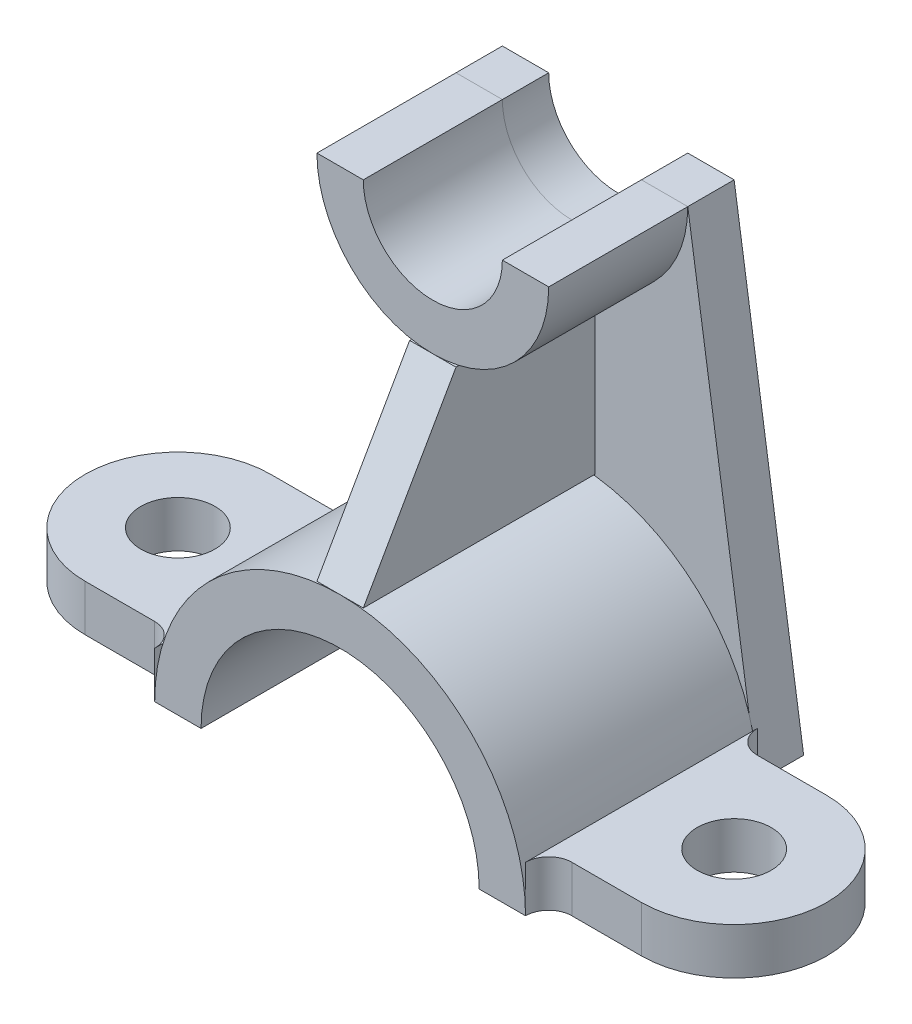
ISO-10303-21;
HEADER;
FILE_DESCRIPTION(('STEP AP214'),'2;1');
FILE_NAME('part.step','',(''),(''),'','','');
FILE_SCHEMA(('AUTOMOTIVE_DESIGN { 1 0 10303 214 1 1 1 1 }'));
ENDSEC;
DATA;
#1=APPLICATION_CONTEXT('core data for automotive mechanical design processes');
#2=APPLICATION_PROTOCOL_DEFINITION('international standard','automotive_design',2000,#1);
#3=PRODUCT_CONTEXT('',#1,'mechanical');
#4=PRODUCT('Part','Part','',(#3));
#5=PRODUCT_RELATED_PRODUCT_CATEGORY('part','',(#4));
#6=PRODUCT_DEFINITION_FORMATION('','',#4);
#7=PRODUCT_DEFINITION_CONTEXT('part definition',#1,'design');
#8=PRODUCT_DEFINITION('design','',#6,#7);
#9=PRODUCT_DEFINITION_SHAPE('','',#8);
#10=(LENGTH_UNIT() NAMED_UNIT(*) SI_UNIT(.MILLI.,.METRE.));
#11=(NAMED_UNIT(*) PLANE_ANGLE_UNIT() SI_UNIT($,.RADIAN.));
#12=(NAMED_UNIT(*) SI_UNIT($,.STERADIAN.) SOLID_ANGLE_UNIT());
#13=UNCERTAINTY_MEASURE_WITH_UNIT(LENGTH_MEASURE(1.E-05),#10,'distance_accuracy_value','');
#14=(GEOMETRIC_REPRESENTATION_CONTEXT(3) GLOBAL_UNCERTAINTY_ASSIGNED_CONTEXT((#13)) GLOBAL_UNIT_ASSIGNED_CONTEXT((#10,
#11,#12)) REPRESENTATION_CONTEXT('',''));
#15=CARTESIAN_POINT('',(0.,0.,0.));
#16=DIRECTION('',(0.,0.,1.));
#17=DIRECTION('',(1.,0.,0.));
#18=AXIS2_PLACEMENT_3D('',#15,#16,#17);
#19=CARTESIAN_POINT('',(-40.,10.,0.));
#20=DIRECTION('',(1.,0.,0.));
#21=DIRECTION('',(0.,0.,1.));
#22=AXIS2_PLACEMENT_3D('',#19,#20,#21);
#23=PLANE('',#22);
#24=DIRECTION('',(0.,0.,-1.));
#25=VECTOR('',#24,1.);
#26=CARTESIAN_POINT('',(-40.,0.,0.));
#27=LINE('',#26,#25);
#28=CARTESIAN_POINT('',(-40.,0.,0.));
#29=VERTEX_POINT('',#28);
#30=CARTESIAN_POINT('',(-40.,0.,-50.));
#31=VERTEX_POINT('',#30);
#32=EDGE_CURVE('E133',#29,#31,#27,.T.);
#33=ORIENTED_EDGE('',*,*,#32,.T.);
#34=DIRECTION('',(0.,-1.,0.));
#35=VECTOR('',#34,1.);
#36=CARTESIAN_POINT('',(-40.,10.,-50.));
#37=LINE('',#36,#35);
#38=CARTESIAN_POINT('',(-40.,10.,-50.));
#39=VERTEX_POINT('',#38);
#40=EDGE_CURVE('E132',#39,#31,#37,.T.);
#41=ORIENTED_EDGE('',*,*,#40,.F.);
#42=DIRECTION('',(0.,0.,-1.));
#43=VECTOR('',#42,1.);
#44=CARTESIAN_POINT('',(-40.,10.,0.));
#45=LINE('',#44,#43);
#46=CARTESIAN_POINT('',(-40.,10.,0.));
#47=VERTEX_POINT('',#46);
#48=EDGE_CURVE('E149',#47,#39,#45,.T.);
#49=ORIENTED_EDGE('',*,*,#48,.F.);
#50=DIRECTION('',(0.,-1.,0.));
#51=VECTOR('',#50,1.);
#52=CARTESIAN_POINT('',(-40.,10.,0.));
#53=LINE('',#52,#51);
#54=EDGE_CURVE('E12',#47,#29,#53,.T.);
#55=ORIENTED_EDGE('',*,*,#54,.T.);
#56=EDGE_LOOP('',(#33,#41,#49,#55));
#57=FACE_BOUND('',#56,.T.);
#58=ADVANCED_FACE('F46',(#57),#23,.T.);
#59=CARTESIAN_POINT('',(-45.,10.,0.));
#60=DIRECTION('',(0.,-1.,0.));
#61=DIRECTION('',(0.,0.,-1.));
#62=AXIS2_PLACEMENT_3D('',#59,#60,#61);
#63=CYLINDRICAL_SURFACE('',#62,5.);
#64=CARTESIAN_POINT('',(-45.,0.,0.));
#65=DIRECTION('',(0.,-1.,0.));
#66=DIRECTION('',(0.,0.,1.));
#67=AXIS2_PLACEMENT_3D('',#64,#65,#66);
#68=CIRCLE('',#67,5.);
#69=CARTESIAN_POINT('',(-45.,0.,-5.));
#70=VERTEX_POINT('',#69);
#71=EDGE_CURVE('E136',#29,#70,#68,.F.);
#72=ORIENTED_EDGE('',*,*,#71,.F.);
#73=ORIENTED_EDGE('',*,*,#54,.F.);
#74=CARTESIAN_POINT('',(-45.,10.,0.));
#75=DIRECTION('',(0.,-1.,0.));
#76=DIRECTION('',(0.,0.,1.));
#77=AXIS2_PLACEMENT_3D('',#74,#75,#76);
#78=CIRCLE('',#77,5.);
#79=CARTESIAN_POINT('',(-45.,10.,-5.));
#80=VERTEX_POINT('',#79);
#81=EDGE_CURVE('E94',#47,#80,#78,.F.);
#82=ORIENTED_EDGE('',*,*,#81,.T.);
#83=DIRECTION('',(0.,-1.,0.));
#84=VECTOR('',#83,1.);
#85=CARTESIAN_POINT('',(-45.,10.,-5.));
#86=LINE('',#85,#84);
#87=EDGE_CURVE('E54',#80,#70,#86,.T.);
#88=ORIENTED_EDGE('',*,*,#87,.T.);
#89=EDGE_LOOP('',(#72,#73,#82,#88));
#90=FACE_BOUND('',#89,.T.);
#91=ADVANCED_FACE('F155',(#90),#63,.F.);
#92=CARTESIAN_POINT('',(0.,10.,-5.));
#93=DIRECTION('',(0.,0.,-1.));
#94=DIRECTION('',(1.,0.,0.));
#95=AXIS2_PLACEMENT_3D('',#92,#93,#94);
#96=PLANE('',#95);
#97=DIRECTION('',(-1.,0.,0.));
#98=VECTOR('',#97,1.);
#99=CARTESIAN_POINT('',(0.,0.,-5.));
#100=LINE('',#99,#98);
#101=CARTESIAN_POINT('',(-60.,0.,-5.));
#102=VERTEX_POINT('',#101);
#103=EDGE_CURVE('E139',#70,#102,#100,.T.);
#104=ORIENTED_EDGE('',*,*,#103,.F.);
#105=ORIENTED_EDGE('',*,*,#87,.F.);
#106=DIRECTION('',(-1.,0.,0.));
#107=VECTOR('',#106,1.);
#108=CARTESIAN_POINT('',(0.,10.,-5.));
#109=LINE('',#108,#107);
#110=CARTESIAN_POINT('',(-60.,10.,-5.));
#111=VERTEX_POINT('',#110);
#112=EDGE_CURVE('E123',#80,#111,#109,.T.);
#113=ORIENTED_EDGE('',*,*,#112,.T.);
#114=DIRECTION('',(0.,-1.,0.));
#115=VECTOR('',#114,1.);
#116=CARTESIAN_POINT('',(-60.,10.,-5.));
#117=LINE('',#116,#115);
#118=EDGE_CURVE('E117',#111,#102,#117,.T.);
#119=ORIENTED_EDGE('',*,*,#118,.T.);
#120=EDGE_LOOP('',(#104,#105,#113,#119));
#121=FACE_BOUND('',#120,.T.);
#122=ADVANCED_FACE('F178',(#121),#96,.F.);
#123=CARTESIAN_POINT('',(-60.,10.,-25.));
#124=DIRECTION('',(0.,-1.,0.));
#125=DIRECTION('',(0.,0.,-1.));
#126=AXIS2_PLACEMENT_3D('',#123,#124,#125);
#127=CYLINDRICAL_SURFACE('',#126,20.);
#128=CARTESIAN_POINT('',(-60.,0.,-25.));
#129=DIRECTION('',(0.,-1.,0.));
#130=DIRECTION('',(0.,0.,1.));
#131=AXIS2_PLACEMENT_3D('',#128,#129,#130);
#132=CIRCLE('',#131,20.);
#133=CARTESIAN_POINT('',(-60.,0.,-45.));
#134=VERTEX_POINT('',#133);
#135=EDGE_CURVE('E142',#102,#134,#132,.T.);
#136=ORIENTED_EDGE('',*,*,#135,.F.);
#137=ORIENTED_EDGE('',*,*,#118,.F.);
#138=CARTESIAN_POINT('',(-60.,10.,-25.));
#139=DIRECTION('',(0.,-1.,0.));
#140=DIRECTION('',(0.,0.,1.));
#141=AXIS2_PLACEMENT_3D('',#138,#139,#140);
#142=CIRCLE('',#141,20.);
#143=CARTESIAN_POINT('',(-60.,10.,-45.));
#144=VERTEX_POINT('',#143);
#145=EDGE_CURVE('E107',#111,#144,#142,.T.);
#146=ORIENTED_EDGE('',*,*,#145,.T.);
#147=DIRECTION('',(0.,-1.,0.));
#148=VECTOR('',#147,1.);
#149=CARTESIAN_POINT('',(-60.,10.,-45.));
#150=LINE('',#149,#148);
#151=EDGE_CURVE('E112',#144,#134,#150,.T.);
#152=ORIENTED_EDGE('',*,*,#151,.T.);
#153=EDGE_LOOP('',(#136,#137,#146,#152));
#154=FACE_BOUND('',#153,.T.);
#155=ADVANCED_FACE('F120',(#154),#127,.T.);
#156=CARTESIAN_POINT('',(0.,10.,-45.));
#157=DIRECTION('',(0.,0.,-1.));
#158=DIRECTION('',(1.,0.,0.));
#159=AXIS2_PLACEMENT_3D('',#156,#157,#158);
#160=PLANE('',#159);
#161=DIRECTION('',(-1.,0.,0.));
#162=VECTOR('',#161,1.);
#163=CARTESIAN_POINT('',(0.,0.,-45.));
#164=LINE('',#163,#162);
#165=CARTESIAN_POINT('',(-45.,0.,-45.));
#166=VERTEX_POINT('',#165);
#167=EDGE_CURVE('E114',#166,#134,#164,.T.);
#168=ORIENTED_EDGE('',*,*,#167,.T.);
#169=ORIENTED_EDGE('',*,*,#151,.F.);
#170=DIRECTION('',(-1.,0.,0.));
#171=VECTOR('',#170,1.);
#172=CARTESIAN_POINT('',(0.,10.,-45.));
#173=LINE('',#172,#171);
#174=CARTESIAN_POINT('',(-45.,10.,-45.));
#175=VERTEX_POINT('',#174);
#176=EDGE_CURVE('E102',#175,#144,#173,.T.);
#177=ORIENTED_EDGE('',*,*,#176,.F.);
#178=DIRECTION('',(0.,-1.,0.));
#179=VECTOR('',#178,1.);
#180=CARTESIAN_POINT('',(-45.,10.,-45.));
#181=LINE('',#180,#179);
#182=EDGE_CURVE('E118',#175,#166,#181,.T.);
#183=ORIENTED_EDGE('',*,*,#182,.T.);
#184=EDGE_LOOP('',(#168,#169,#177,#183));
#185=FACE_BOUND('',#184,.T.);
#186=ADVANCED_FACE('F113',(#185),#160,.T.);
#187=CARTESIAN_POINT('',(-45.,10.,-50.));
#188=DIRECTION('',(0.,-1.,0.));
#189=DIRECTION('',(0.,0.,-1.));
#190=AXIS2_PLACEMENT_3D('',#187,#188,#189);
#191=CYLINDRICAL_SURFACE('',#190,5.);
#192=CARTESIAN_POINT('',(-45.,0.,-50.));
#193=DIRECTION('',(0.,-1.,0.));
#194=DIRECTION('',(0.,0.,1.));
#195=AXIS2_PLACEMENT_3D('',#192,#193,#194);
#196=CIRCLE('',#195,5.);
#197=EDGE_CURVE('E82',#31,#166,#196,.T.);
#198=ORIENTED_EDGE('',*,*,#197,.T.);
#199=ORIENTED_EDGE('',*,*,#182,.F.);
#200=CARTESIAN_POINT('',(-45.,10.,-50.));
#201=DIRECTION('',(0.,-1.,0.));
#202=DIRECTION('',(0.,0.,1.));
#203=AXIS2_PLACEMENT_3D('',#200,#201,#202);
#204=CIRCLE('',#203,5.);
#205=EDGE_CURVE('E62',#39,#175,#204,.T.);
#206=ORIENTED_EDGE('',*,*,#205,.F.);
#207=ORIENTED_EDGE('',*,*,#40,.T.);
#208=EDGE_LOOP('',(#198,#199,#206,#207));
#209=FACE_BOUND('',#208,.T.);
#210=ADVANCED_FACE('F163',(#209),#191,.F.);
#211=CARTESIAN_POINT('',(-60.,10.,-25.));
#212=DIRECTION('',(0.,-1.,0.));
#213=DIRECTION('',(0.,0.,-1.));
#214=AXIS2_PLACEMENT_3D('',#211,#212,#213);
#215=CYLINDRICAL_SURFACE('',#214,8.00000000000001);
#216=CARTESIAN_POINT('',(-60.,10.,-25.));
#217=DIRECTION('',(0.,-1.,0.));
#218=DIRECTION('',(0.,0.,1.));
#219=AXIS2_PLACEMENT_3D('',#216,#217,#218);
#220=CIRCLE('',#219,8.00000000000001);
#221=CARTESIAN_POINT('',(-60.,10.,-17.));
#222=VERTEX_POINT('',#221);
#223=EDGE_CURVE('E129',#222,#222,#220,.T.);
#224=ORIENTED_EDGE('',*,*,#223,.F.);
#225=EDGE_LOOP('',(#224));
#226=FACE_BOUND('',#225,.T.);
#227=CARTESIAN_POINT('',(-60.,0.,-25.));
#228=DIRECTION('',(0.,-1.,0.));
#229=DIRECTION('',(0.,0.,1.));
#230=AXIS2_PLACEMENT_3D('',#227,#228,#229);
#231=CIRCLE('',#230,8.00000000000001);
#232=CARTESIAN_POINT('',(-60.,0.,-17.));
#233=VERTEX_POINT('',#232);
#234=EDGE_CURVE('E146',#233,#233,#231,.T.);
#235=ORIENTED_EDGE('',*,*,#234,.T.);
#236=EDGE_LOOP('',(#235));
#237=FACE_BOUND('',#236,.T.);
#238=ADVANCED_FACE('F165',(#226,#237),#215,.F.);
#239=CARTESIAN_POINT('',(0.,10.,0.));
#240=DIRECTION('',(0.,1.,0.));
#241=DIRECTION('',(0.,0.,1.));
#242=AXIS2_PLACEMENT_3D('',#239,#240,#241);
#243=PLANE('',#242);
#244=ORIENTED_EDGE('',*,*,#48,.T.);
#245=ORIENTED_EDGE('',*,*,#205,.T.);
#246=ORIENTED_EDGE('',*,*,#176,.T.);
#247=ORIENTED_EDGE('',*,*,#145,.F.);
#248=ORIENTED_EDGE('',*,*,#112,.F.);
#249=ORIENTED_EDGE('',*,*,#81,.F.);
#250=EDGE_LOOP('',(#244,#245,#246,#247,#248,#249));
#251=FACE_BOUND('',#250,.T.);
#252=ORIENTED_EDGE('',*,*,#223,.T.);
#253=EDGE_LOOP('',(#252));
#254=FACE_BOUND('',#253,.T.);
#255=ADVANCED_FACE('F104',(#251,#254),#243,.T.);
#256=CARTESIAN_POINT('',(0.,0.,0.));
#257=DIRECTION('',(0.,1.,0.));
#258=DIRECTION('',(0.,0.,1.));
#259=AXIS2_PLACEMENT_3D('',#256,#257,#258);
#260=PLANE('',#259);
#261=ORIENTED_EDGE('',*,*,#32,.F.);
#262=ORIENTED_EDGE('',*,*,#71,.T.);
#263=ORIENTED_EDGE('',*,*,#103,.T.);
#264=ORIENTED_EDGE('',*,*,#135,.T.);
#265=ORIENTED_EDGE('',*,*,#167,.F.);
#266=ORIENTED_EDGE('',*,*,#197,.F.);
#267=EDGE_LOOP('',(#261,#262,#263,#264,#265,#266));
#268=FACE_BOUND('',#267,.T.);
#269=ORIENTED_EDGE('',*,*,#234,.F.);
#270=EDGE_LOOP('',(#269));
#271=FACE_BOUND('',#270,.T.);
#272=ADVANCED_FACE('F157',(#268,#271),#260,.F.);
#273=CLOSED_SHELL('',(#58,#91,#122,#155,#186,#210,#238,#255,#272));
#274=MANIFOLD_SOLID_BREP('B2',#273);
#275=CARTESIAN_POINT('',(40.,10.,0.));
#276=DIRECTION('',(-1.,0.,0.));
#277=DIRECTION('',(0.,0.,1.));
#278=AXIS2_PLACEMENT_3D('',#275,#276,#277);
#279=PLANE('',#278);
#280=DIRECTION('',(0.,0.,-1.));
#281=VECTOR('',#280,1.);
#282=CARTESIAN_POINT('',(40.,0.,0.));
#283=LINE('',#282,#281);
#284=CARTESIAN_POINT('',(40.,0.,0.));
#285=VERTEX_POINT('',#284);
#286=CARTESIAN_POINT('',(40.,0.,-50.));
#287=VERTEX_POINT('',#286);
#288=EDGE_CURVE('E366',#285,#287,#283,.T.);
#289=ORIENTED_EDGE('',*,*,#288,.F.);
#290=DIRECTION('',(0.,-1.,0.));
#291=VECTOR('',#290,1.);
#292=CARTESIAN_POINT('',(40.,10.,0.));
#293=LINE('',#292,#291);
#294=CARTESIAN_POINT('',(40.,10.,0.));
#295=VERTEX_POINT('',#294);
#296=EDGE_CURVE('E44',#295,#285,#293,.T.);
#297=ORIENTED_EDGE('',*,*,#296,.F.);
#298=DIRECTION('',(0.,0.,-1.));
#299=VECTOR('',#298,1.);
#300=CARTESIAN_POINT('',(40.,10.,0.));
#301=LINE('',#300,#299);
#302=CARTESIAN_POINT('',(40.,10.,-50.));
#303=VERTEX_POINT('',#302);
#304=EDGE_CURVE('E381',#295,#303,#301,.T.);
#305=ORIENTED_EDGE('',*,*,#304,.T.);
#306=DIRECTION('',(0.,-1.,0.));
#307=VECTOR('',#306,1.);
#308=CARTESIAN_POINT('',(40.,10.,-50.));
#309=LINE('',#308,#307);
#310=EDGE_CURVE('E296',#303,#287,#309,.T.);
#311=ORIENTED_EDGE('',*,*,#310,.T.);
#312=EDGE_LOOP('',(#289,#297,#305,#311));
#313=FACE_BOUND('',#312,.T.);
#314=ADVANCED_FACE('F280',(#313),#279,.T.);
#315=CARTESIAN_POINT('',(45.,10.,0.));
#316=DIRECTION('',(0.,-1.,0.));
#317=DIRECTION('',(0.,0.,-1.));
#318=AXIS2_PLACEMENT_3D('',#315,#316,#317);
#319=CYLINDRICAL_SURFACE('',#318,5.);
#320=CARTESIAN_POINT('',(45.,0.,0.));
#321=DIRECTION('',(0.,1.,0.));
#322=DIRECTION('',(0.,0.,1.));
#323=AXIS2_PLACEMENT_3D('',#320,#321,#322);
#324=CIRCLE('',#323,5.);
#325=CARTESIAN_POINT('',(45.,0.,-5.));
#326=VERTEX_POINT('',#325);
#327=EDGE_CURVE('E368',#285,#326,#324,.F.);
#328=ORIENTED_EDGE('',*,*,#327,.T.);
#329=DIRECTION('',(0.,-1.,0.));
#330=VECTOR('',#329,1.);
#331=CARTESIAN_POINT('',(45.,10.,-5.));
#332=LINE('',#331,#330);
#333=CARTESIAN_POINT('',(45.,10.,-5.));
#334=VERTEX_POINT('',#333);
#335=EDGE_CURVE('E288',#334,#326,#332,.T.);
#336=ORIENTED_EDGE('',*,*,#335,.F.);
#337=CARTESIAN_POINT('',(45.,10.,0.));
#338=DIRECTION('',(0.,1.,0.));
#339=DIRECTION('',(0.,0.,1.));
#340=AXIS2_PLACEMENT_3D('',#337,#338,#339);
#341=CIRCLE('',#340,5.);
#342=EDGE_CURVE('E495',#295,#334,#341,.F.);
#343=ORIENTED_EDGE('',*,*,#342,.F.);
#344=ORIENTED_EDGE('',*,*,#296,.T.);
#345=EDGE_LOOP('',(#328,#336,#343,#344));
#346=FACE_BOUND('',#345,.T.);
#347=ADVANCED_FACE('F406',(#346),#319,.F.);
#348=CARTESIAN_POINT('',(0.,10.,-5.));
#349=DIRECTION('',(0.,0.,-1.));
#350=DIRECTION('',(-1.,0.,0.));
#351=AXIS2_PLACEMENT_3D('',#348,#349,#350);
#352=PLANE('',#351);
#353=DIRECTION('',(1.,0.,0.));
#354=VECTOR('',#353,1.);
#355=CARTESIAN_POINT('',(0.,0.,-5.));
#356=LINE('',#355,#354);
#357=CARTESIAN_POINT('',(60.,0.,-5.));
#358=VERTEX_POINT('',#357);
#359=EDGE_CURVE('E370',#326,#358,#356,.T.);
#360=ORIENTED_EDGE('',*,*,#359,.T.);
#361=DIRECTION('',(0.,-1.,0.));
#362=VECTOR('',#361,1.);
#363=CARTESIAN_POINT('',(60.,10.,-5.));
#364=LINE('',#363,#362);
#365=CARTESIAN_POINT('',(60.,10.,-5.));
#366=VERTEX_POINT('',#365);
#367=EDGE_CURVE('E355',#366,#358,#364,.T.);
#368=ORIENTED_EDGE('',*,*,#367,.F.);
#369=DIRECTION('',(1.,0.,0.));
#370=VECTOR('',#369,1.);
#371=CARTESIAN_POINT('',(0.,10.,-5.));
#372=LINE('',#371,#370);
#373=EDGE_CURVE('E343',#334,#366,#372,.T.);
#374=ORIENTED_EDGE('',*,*,#373,.F.);
#375=ORIENTED_EDGE('',*,*,#335,.T.);
#376=EDGE_LOOP('',(#360,#368,#374,#375));
#377=FACE_BOUND('',#376,.T.);
#378=ADVANCED_FACE('F388',(#377),#352,.F.);
#379=CARTESIAN_POINT('',(60.,10.,-25.));
#380=DIRECTION('',(0.,-1.,0.));
#381=DIRECTION('',(0.,0.,-1.));
#382=AXIS2_PLACEMENT_3D('',#379,#380,#381);
#383=CYLINDRICAL_SURFACE('',#382,20.);
#384=CARTESIAN_POINT('',(60.,0.,-25.));
#385=DIRECTION('',(0.,1.,0.));
#386=DIRECTION('',(0.,0.,1.));
#387=AXIS2_PLACEMENT_3D('',#384,#385,#386);
#388=CIRCLE('',#387,20.);
#389=CARTESIAN_POINT('',(60.,0.,-45.));
#390=VERTEX_POINT('',#389);
#391=EDGE_CURVE('E352',#358,#390,#388,.T.);
#392=ORIENTED_EDGE('',*,*,#391,.T.);
#393=DIRECTION('',(0.,-1.,0.));
#394=VECTOR('',#393,1.);
#395=CARTESIAN_POINT('',(60.,10.,-45.));
#396=LINE('',#395,#394);
#397=CARTESIAN_POINT('',(60.,10.,-45.));
#398=VERTEX_POINT('',#397);
#399=EDGE_CURVE('E349',#398,#390,#396,.T.);
#400=ORIENTED_EDGE('',*,*,#399,.F.);
#401=CARTESIAN_POINT('',(60.,10.,-25.));
#402=DIRECTION('',(0.,1.,0.));
#403=DIRECTION('',(0.,0.,1.));
#404=AXIS2_PLACEMENT_3D('',#401,#402,#403);
#405=CIRCLE('',#404,20.);
#406=EDGE_CURVE('E334',#366,#398,#405,.T.);
#407=ORIENTED_EDGE('',*,*,#406,.F.);
#408=ORIENTED_EDGE('',*,*,#367,.T.);
#409=EDGE_LOOP('',(#392,#400,#407,#408));
#410=FACE_BOUND('',#409,.T.);
#411=ADVANCED_FACE('F350',(#410),#383,.T.);
#412=CARTESIAN_POINT('',(0.,10.,-45.));
#413=DIRECTION('',(0.,0.,-1.));
#414=DIRECTION('',(-1.,0.,0.));
#415=AXIS2_PLACEMENT_3D('',#412,#413,#414);
#416=PLANE('',#415);
#417=DIRECTION('',(1.,0.,0.));
#418=VECTOR('',#417,1.);
#419=CARTESIAN_POINT('',(0.,0.,-45.));
#420=LINE('',#419,#418);
#421=CARTESIAN_POINT('',(45.,0.,-45.));
#422=VERTEX_POINT('',#421);
#423=EDGE_CURVE('E373',#422,#390,#420,.T.);
#424=ORIENTED_EDGE('',*,*,#423,.F.);
#425=DIRECTION('',(0.,-1.,0.));
#426=VECTOR('',#425,1.);
#427=CARTESIAN_POINT('',(45.,10.,-45.));
#428=LINE('',#427,#426);
#429=CARTESIAN_POINT('',(45.,10.,-45.));
#430=VERTEX_POINT('',#429);
#431=EDGE_CURVE('E315',#430,#422,#428,.T.);
#432=ORIENTED_EDGE('',*,*,#431,.F.);
#433=DIRECTION('',(1.,0.,0.));
#434=VECTOR('',#433,1.);
#435=CARTESIAN_POINT('',(0.,10.,-45.));
#436=LINE('',#435,#434);
#437=EDGE_CURVE('E341',#430,#398,#436,.T.);
#438=ORIENTED_EDGE('',*,*,#437,.T.);
#439=ORIENTED_EDGE('',*,*,#399,.T.);
#440=EDGE_LOOP('',(#424,#432,#438,#439));
#441=FACE_BOUND('',#440,.T.);
#442=ADVANCED_FACE('F357',(#441),#416,.T.);
#443=CARTESIAN_POINT('',(45.,10.,-50.));
#444=DIRECTION('',(0.,-1.,0.));
#445=DIRECTION('',(0.,0.,-1.));
#446=AXIS2_PLACEMENT_3D('',#443,#444,#445);
#447=CYLINDRICAL_SURFACE('',#446,5.);
#448=CARTESIAN_POINT('',(45.,0.,-50.));
#449=DIRECTION('',(0.,1.,0.));
#450=DIRECTION('',(0.,0.,1.));
#451=AXIS2_PLACEMENT_3D('',#448,#449,#450);
#452=CIRCLE('',#451,5.);
#453=EDGE_CURVE('E375',#287,#422,#452,.T.);
#454=ORIENTED_EDGE('',*,*,#453,.F.);
#455=ORIENTED_EDGE('',*,*,#310,.F.);
#456=CARTESIAN_POINT('',(45.,10.,-50.));
#457=DIRECTION('',(0.,1.,0.));
#458=DIRECTION('',(0.,0.,1.));
#459=AXIS2_PLACEMENT_3D('',#456,#457,#458);
#460=CIRCLE('',#459,5.);
#461=EDGE_CURVE('E358',#303,#430,#460,.T.);
#462=ORIENTED_EDGE('',*,*,#461,.T.);
#463=ORIENTED_EDGE('',*,*,#431,.T.);
#464=EDGE_LOOP('',(#454,#455,#462,#463));
#465=FACE_BOUND('',#464,.T.);
#466=ADVANCED_FACE('F394',(#465),#447,.F.);
#467=CARTESIAN_POINT('',(60.,10.,-25.));
#468=DIRECTION('',(0.,-1.,0.));
#469=DIRECTION('',(0.,0.,-1.));
#470=AXIS2_PLACEMENT_3D('',#467,#468,#469);
#471=CYLINDRICAL_SURFACE('',#470,8.00000000000001);
#472=CARTESIAN_POINT('',(60.,10.,-25.));
#473=DIRECTION('',(0.,1.,0.));
#474=DIRECTION('',(0.,0.,1.));
#475=AXIS2_PLACEMENT_3D('',#472,#473,#474);
#476=CIRCLE('',#475,8.00000000000001);
#477=CARTESIAN_POINT('',(60.,10.,-17.));
#478=VERTEX_POINT('',#477);
#479=EDGE_CURVE('E360',#478,#478,#476,.T.);
#480=ORIENTED_EDGE('',*,*,#479,.T.);
#481=EDGE_LOOP('',(#480));
#482=FACE_BOUND('',#481,.T.);
#483=CARTESIAN_POINT('',(60.,0.,-25.));
#484=DIRECTION('',(0.,1.,0.));
#485=DIRECTION('',(0.,0.,1.));
#486=AXIS2_PLACEMENT_3D('',#483,#484,#485);
#487=CIRCLE('',#486,8.00000000000001);
#488=CARTESIAN_POINT('',(60.,0.,-17.));
#489=VERTEX_POINT('',#488);
#490=EDGE_CURVE('E378',#489,#489,#487,.T.);
#491=ORIENTED_EDGE('',*,*,#490,.F.);
#492=EDGE_LOOP('',(#491));
#493=FACE_BOUND('',#492,.T.);
#494=ADVANCED_FACE('F396',(#482,#493),#471,.F.);
#495=CARTESIAN_POINT('',(0.,10.,0.));
#496=DIRECTION('',(0.,1.,0.));
#497=DIRECTION('',(0.,0.,1.));
#498=AXIS2_PLACEMENT_3D('',#495,#496,#497);
#499=PLANE('',#498);
#500=ORIENTED_EDGE('',*,*,#304,.F.);
#501=ORIENTED_EDGE('',*,*,#342,.T.);
#502=ORIENTED_EDGE('',*,*,#373,.T.);
#503=ORIENTED_EDGE('',*,*,#406,.T.);
#504=ORIENTED_EDGE('',*,*,#437,.F.);
#505=ORIENTED_EDGE('',*,*,#461,.F.);
#506=EDGE_LOOP('',(#500,#501,#502,#503,#504,#505));
#507=FACE_BOUND('',#506,.T.);
#508=ORIENTED_EDGE('',*,*,#479,.F.);
#509=EDGE_LOOP('',(#508));
#510=FACE_BOUND('',#509,.T.);
#511=ADVANCED_FACE('F337',(#507,#510),#499,.T.);
#512=CARTESIAN_POINT('',(0.,0.,0.));
#513=DIRECTION('',(0.,1.,0.));
#514=DIRECTION('',(0.,0.,1.));
#515=AXIS2_PLACEMENT_3D('',#512,#513,#514);
#516=PLANE('',#515);
#517=ORIENTED_EDGE('',*,*,#288,.T.);
#518=ORIENTED_EDGE('',*,*,#453,.T.);
#519=ORIENTED_EDGE('',*,*,#423,.T.);
#520=ORIENTED_EDGE('',*,*,#391,.F.);
#521=ORIENTED_EDGE('',*,*,#359,.F.);
#522=ORIENTED_EDGE('',*,*,#327,.F.);
#523=EDGE_LOOP('',(#517,#518,#519,#520,#521,#522));
#524=FACE_BOUND('',#523,.T.);
#525=ORIENTED_EDGE('',*,*,#490,.T.);
#526=EDGE_LOOP('',(#525));
#527=FACE_BOUND('',#526,.T.);
#528=ADVANCED_FACE('F392',(#524,#527),#516,.F.);
#529=CLOSED_SHELL('',(#314,#347,#378,#411,#442,#466,#494,#511,#528));
#530=MANIFOLD_SOLID_BREP('B6',#529);
#531=CARTESIAN_POINT('',(0.,100.,-50.));
#532=DIRECTION('',(0.,0.,1.));
#533=DIRECTION('',(0.,-1.,0.));
#534=AXIS2_PLACEMENT_3D('',#531,#532,#533);
#535=CYLINDRICAL_SURFACE('',#534,15.);
#536=CARTESIAN_POINT('',(0.,100.,-20.));
#537=DIRECTION('',(0.,0.,-1.));
#538=DIRECTION('',(0.,1.,0.));
#539=AXIS2_PLACEMENT_3D('',#536,#537,#538);
#540=CIRCLE('',#539,15.);
#541=CARTESIAN_POINT('',(15.,100.,-20.));
#542=VERTEX_POINT('',#541);
#543=CARTESIAN_POINT('',(-15.,100.,-20.));
#544=VERTEX_POINT('',#543);
#545=EDGE_CURVE('E578',#542,#544,#540,.T.);
#546=ORIENTED_EDGE('',*,*,#545,.F.);
#547=DIRECTION('',(0.,0.,1.));
#548=VECTOR('',#547,1.);
#549=CARTESIAN_POINT('',(15.,100.,-50.));
#550=LINE('',#549,#548);
#551=CARTESIAN_POINT('',(15.,100.,-50.));
#552=VERTEX_POINT('',#551);
#553=EDGE_CURVE('E278',#552,#542,#550,.T.);
#554=ORIENTED_EDGE('',*,*,#553,.F.);
#555=CARTESIAN_POINT('',(0.,100.,-50.));
#556=DIRECTION('',(0.,0.,-1.));
#557=DIRECTION('',(0.,1.,0.));
#558=AXIS2_PLACEMENT_3D('',#555,#556,#557);
#559=CIRCLE('',#558,15.);
#560=CARTESIAN_POINT('',(-15.,100.,-50.));
#561=VERTEX_POINT('',#560);
#562=EDGE_CURVE('E572',#552,#561,#559,.T.);
#563=ORIENTED_EDGE('',*,*,#562,.T.);
#564=DIRECTION('',(0.,0.,1.));
#565=VECTOR('',#564,1.);
#566=CARTESIAN_POINT('',(-15.,100.,-50.));
#567=LINE('',#566,#565);
#568=EDGE_CURVE('E530',#561,#544,#567,.T.);
#569=ORIENTED_EDGE('',*,*,#568,.T.);
#570=EDGE_LOOP('',(#546,#554,#563,#569));
#571=FACE_BOUND('',#570,.T.);
#572=ADVANCED_FACE('F514',(#571),#535,.F.);
#573=CARTESIAN_POINT('',(0.,100.,-50.));
#574=DIRECTION('',(0.,1.,0.));
#575=DIRECTION('',(0.,0.,1.));
#576=AXIS2_PLACEMENT_3D('',#573,#574,#575);
#577=PLANE('',#576);
#578=DIRECTION('',(-1.,0.,0.));
#579=VECTOR('',#578,1.);
#580=CARTESIAN_POINT('',(0.,100.,-20.));
#581=LINE('',#580,#579);
#582=CARTESIAN_POINT('',(25.,100.,-20.));
#583=VERTEX_POINT('',#582);
#584=EDGE_CURVE('E562',#583,#542,#581,.T.);
#585=ORIENTED_EDGE('',*,*,#584,.F.);
#586=DIRECTION('',(0.,0.,1.));
#587=VECTOR('',#586,1.);
#588=CARTESIAN_POINT('',(25.,100.,-50.));
#589=LINE('',#588,#587);
#590=CARTESIAN_POINT('',(25.,100.,-50.));
#591=VERTEX_POINT('',#590);
#592=EDGE_CURVE('E522',#591,#583,#589,.T.);
#593=ORIENTED_EDGE('',*,*,#592,.F.);
#594=DIRECTION('',(-1.,0.,0.));
#595=VECTOR('',#594,1.);
#596=CARTESIAN_POINT('',(0.,100.,-50.));
#597=LINE('',#596,#595);
#598=EDGE_CURVE('E560',#591,#552,#597,.T.);
#599=ORIENTED_EDGE('',*,*,#598,.T.);
#600=ORIENTED_EDGE('',*,*,#553,.T.);
#601=EDGE_LOOP('',(#585,#593,#599,#600));
#602=FACE_BOUND('',#601,.T.);
#603=ADVANCED_FACE('F558',(#602),#577,.T.);
#604=CARTESIAN_POINT('',(0.,100.,-50.));
#605=DIRECTION('',(0.,0.,1.));
#606=DIRECTION('',(0.,-1.,0.));
#607=AXIS2_PLACEMENT_3D('',#604,#605,#606);
#608=CYLINDRICAL_SURFACE('',#607,25.);
#609=CARTESIAN_POINT('',(0.,100.,-20.));
#610=DIRECTION('',(0.,0.,-1.));
#611=DIRECTION('',(0.,1.,0.));
#612=AXIS2_PLACEMENT_3D('',#609,#610,#611);
#613=CIRCLE('',#612,25.);
#614=CARTESIAN_POINT('',(-25.,100.,-20.));
#615=VERTEX_POINT('',#614);
#616=EDGE_CURVE('E581',#583,#615,#613,.T.);
#617=ORIENTED_EDGE('',*,*,#616,.T.);
#618=DIRECTION('',(0.,0.,1.));
#619=VECTOR('',#618,1.);
#620=CARTESIAN_POINT('',(-25.,100.,-50.));
#621=LINE('',#620,#619);
#622=CARTESIAN_POINT('',(-25.,100.,-50.));
#623=VERTEX_POINT('',#622);
#624=EDGE_CURVE('E544',#623,#615,#621,.T.);
#625=ORIENTED_EDGE('',*,*,#624,.F.);
#626=CARTESIAN_POINT('',(0.,100.,-50.));
#627=DIRECTION('',(0.,0.,-1.));
#628=DIRECTION('',(0.,1.,0.));
#629=AXIS2_PLACEMENT_3D('',#626,#627,#628);
#630=CIRCLE('',#629,25.);
#631=EDGE_CURVE('E565',#591,#623,#630,.T.);
#632=ORIENTED_EDGE('',*,*,#631,.F.);
#633=ORIENTED_EDGE('',*,*,#592,.T.);
#634=EDGE_LOOP('',(#617,#625,#632,#633));
#635=FACE_BOUND('',#634,.T.);
#636=ADVANCED_FACE('F566',(#635),#608,.T.);
#637=CARTESIAN_POINT('',(0.,100.,-50.));
#638=DIRECTION('',(0.,1.,0.));
#639=DIRECTION('',(0.,0.,1.));
#640=AXIS2_PLACEMENT_3D('',#637,#638,#639);
#641=PLANE('',#640);
#642=DIRECTION('',(-1.,0.,0.));
#643=VECTOR('',#642,1.);
#644=CARTESIAN_POINT('',(0.,100.,-20.));
#645=LINE('',#644,#643);
#646=EDGE_CURVE('E574',#544,#615,#645,.T.);
#647=ORIENTED_EDGE('',*,*,#646,.F.);
#648=ORIENTED_EDGE('',*,*,#568,.F.);
#649=DIRECTION('',(-1.,0.,0.));
#650=VECTOR('',#649,1.);
#651=CARTESIAN_POINT('',(0.,100.,-50.));
#652=LINE('',#651,#650);
#653=EDGE_CURVE('E569',#561,#623,#652,.T.);
#654=ORIENTED_EDGE('',*,*,#653,.T.);
#655=ORIENTED_EDGE('',*,*,#624,.T.);
#656=EDGE_LOOP('',(#647,#648,#654,#655));
#657=FACE_BOUND('',#656,.T.);
#658=ADVANCED_FACE('F588',(#657),#641,.T.);
#659=CARTESIAN_POINT('',(0.,0.,-50.));
#660=DIRECTION('',(0.,0.,-1.));
#661=DIRECTION('',(0.,1.,0.));
#662=AXIS2_PLACEMENT_3D('',#659,#660,#661);
#663=PLANE('',#662);
#664=ORIENTED_EDGE('',*,*,#562,.F.);
#665=ORIENTED_EDGE('',*,*,#598,.F.);
#666=ORIENTED_EDGE('',*,*,#631,.T.);
#667=ORIENTED_EDGE('',*,*,#653,.F.);
#668=EDGE_LOOP('',(#664,#665,#666,#667));
#669=FACE_BOUND('',#668,.T.);
#670=ADVANCED_FACE('F571',(#669),#663,.T.);
#671=CARTESIAN_POINT('',(0.,0.,-20.));
#672=DIRECTION('',(0.,0.,-1.));
#673=DIRECTION('',(0.,1.,0.));
#674=AXIS2_PLACEMENT_3D('',#671,#672,#673);
#675=PLANE('',#674);
#676=ORIENTED_EDGE('',*,*,#545,.T.);
#677=ORIENTED_EDGE('',*,*,#646,.T.);
#678=ORIENTED_EDGE('',*,*,#616,.F.);
#679=ORIENTED_EDGE('',*,*,#584,.T.);
#680=EDGE_LOOP('',(#676,#677,#678,#679));
#681=FACE_BOUND('',#680,.T.);
#682=ADVANCED_FACE('F587',(#681),#675,.F.);
#683=CLOSED_SHELL('',(#572,#603,#636,#658,#670,#682));
#684=MANIFOLD_SOLID_BREP('B38',#683);
#685=CARTESIAN_POINT('',(5.,40.,-50.));
#686=DIRECTION('',(0.,1.,0.));
#687=DIRECTION('',(0.,0.,1.));
#688=AXIS2_PLACEMENT_3D('',#685,#686,#687);
#689=PLANE('',#688);
#690=DIRECTION('',(0.,0.,-1.));
#691=VECTOR('',#690,1.);
#692=CARTESIAN_POINT('',(-5.,40.,-50.));
#693=LINE('',#692,#691);
#694=CARTESIAN_POINT('',(-5.,40.,0.));
#695=VERTEX_POINT('',#694);
#696=CARTESIAN_POINT('',(-5.,40.,-50.));
#697=VERTEX_POINT('',#696);
#698=EDGE_CURVE('E716',#695,#697,#693,.T.);
#699=ORIENTED_EDGE('',*,*,#698,.T.);
#700=DIRECTION('',(-1.,0.,0.));
#701=VECTOR('',#700,1.);
#702=CARTESIAN_POINT('',(5.,40.,-50.));
#703=LINE('',#702,#701);
#704=CARTESIAN_POINT('',(5.,40.,-50.));
#705=VERTEX_POINT('',#704);
#706=EDGE_CURVE('E512',#705,#697,#703,.T.);
#707=ORIENTED_EDGE('',*,*,#706,.F.);
#708=DIRECTION('',(0.,0.,-1.));
#709=VECTOR('',#708,1.);
#710=CARTESIAN_POINT('',(5.,40.,-50.));
#711=LINE('',#710,#709);
#712=CARTESIAN_POINT('',(5.,40.,0.));
#713=VERTEX_POINT('',#712);
#714=EDGE_CURVE('E704',#713,#705,#711,.T.);
#715=ORIENTED_EDGE('',*,*,#714,.F.);
#716=DIRECTION('',(-1.,0.,0.));
#717=VECTOR('',#716,1.);
#718=CARTESIAN_POINT('',(5.,40.,0.));
#719=LINE('',#718,#717);
#720=EDGE_CURVE('E712',#713,#695,#719,.T.);
#721=ORIENTED_EDGE('',*,*,#720,.T.);
#722=EDGE_LOOP('',(#699,#707,#715,#721));
#723=FACE_BOUND('',#722,.T.);
#724=ADVANCED_FACE('F653',(#723),#689,.F.);
#725=CARTESIAN_POINT('',(5.,75.,-50.));
#726=DIRECTION('',(0.,0.,1.));
#727=DIRECTION('',(0.,-1.,0.));
#728=AXIS2_PLACEMENT_3D('',#725,#726,#727);
#729=PLANE('',#728);
#730=DIRECTION('',(0.,1.,0.));
#731=VECTOR('',#730,1.);
#732=CARTESIAN_POINT('',(-5.,75.,-50.));
#733=LINE('',#732,#731);
#734=CARTESIAN_POINT('',(-5.,75.,-50.));
#735=VERTEX_POINT('',#734);
#736=EDGE_CURVE('E708',#697,#735,#733,.T.);
#737=ORIENTED_EDGE('',*,*,#736,.T.);
#738=DIRECTION('',(-1.,0.,0.));
#739=VECTOR('',#738,1.);
#740=CARTESIAN_POINT('',(5.,75.,-50.));
#741=LINE('',#740,#739);
#742=CARTESIAN_POINT('',(5.,75.,-50.));
#743=VERTEX_POINT('',#742);
#744=EDGE_CURVE('E661',#743,#735,#741,.T.);
#745=ORIENTED_EDGE('',*,*,#744,.F.);
#746=DIRECTION('',(0.,1.,0.));
#747=VECTOR('',#746,1.);
#748=CARTESIAN_POINT('',(5.,75.,-50.));
#749=LINE('',#748,#747);
#750=EDGE_CURVE('E699',#705,#743,#749,.T.);
#751=ORIENTED_EDGE('',*,*,#750,.F.);
#752=ORIENTED_EDGE('',*,*,#706,.T.);
#753=EDGE_LOOP('',(#737,#745,#751,#752));
#754=FACE_BOUND('',#753,.T.);
#755=ADVANCED_FACE('F707',(#754),#729,.F.);
#756=CARTESIAN_POINT('',(5.,75.,-20.));
#757=DIRECTION('',(0.,-1.,0.));
#758=DIRECTION('',(0.,0.,-1.));
#759=AXIS2_PLACEMENT_3D('',#756,#757,#758);
#760=PLANE('',#759);
#761=DIRECTION('',(0.,0.,1.));
#762=VECTOR('',#761,1.);
#763=CARTESIAN_POINT('',(-5.,75.,-20.));
#764=LINE('',#763,#762);
#765=CARTESIAN_POINT('',(-5.,75.,-20.));
#766=VERTEX_POINT('',#765);
#767=EDGE_CURVE('E686',#735,#766,#764,.T.);
#768=ORIENTED_EDGE('',*,*,#767,.T.);
#769=DIRECTION('',(-1.,0.,0.));
#770=VECTOR('',#769,1.);
#771=CARTESIAN_POINT('',(5.,75.,-20.));
#772=LINE('',#771,#770);
#773=CARTESIAN_POINT('',(5.,75.,-20.));
#774=VERTEX_POINT('',#773);
#775=EDGE_CURVE('E709',#774,#766,#772,.T.);
#776=ORIENTED_EDGE('',*,*,#775,.F.);
#777=DIRECTION('',(0.,0.,1.));
#778=VECTOR('',#777,1.);
#779=CARTESIAN_POINT('',(5.,75.,-20.));
#780=LINE('',#779,#778);
#781=EDGE_CURVE('E702',#743,#774,#780,.T.);
#782=ORIENTED_EDGE('',*,*,#781,.F.);
#783=ORIENTED_EDGE('',*,*,#744,.T.);
#784=EDGE_LOOP('',(#768,#776,#782,#783));
#785=FACE_BOUND('',#784,.T.);
#786=ADVANCED_FACE('F710',(#785),#760,.F.);
#787=CARTESIAN_POINT('',(5.,40.,0.));
#788=DIRECTION('',(0.,-0.496138938356834,-0.868243142124459));
#789=DIRECTION('',(0.,0.868243142124459,-0.496138938356834));
#790=AXIS2_PLACEMENT_3D('',#787,#788,#789);
#791=PLANE('',#790);
#792=DIRECTION('',(0.,-0.868243142124459,0.496138938356834));
#793=VECTOR('',#792,1.);
#794=CARTESIAN_POINT('',(-5.,40.,0.));
#795=LINE('',#794,#793);
#796=EDGE_CURVE('E692',#766,#695,#795,.T.);
#797=ORIENTED_EDGE('',*,*,#796,.T.);
#798=ORIENTED_EDGE('',*,*,#720,.F.);
#799=DIRECTION('',(0.,-0.868243142124459,0.496138938356834));
#800=VECTOR('',#799,1.);
#801=CARTESIAN_POINT('',(5.,40.,0.));
#802=LINE('',#801,#800);
#803=EDGE_CURVE('E669',#774,#713,#802,.T.);
#804=ORIENTED_EDGE('',*,*,#803,.F.);
#805=ORIENTED_EDGE('',*,*,#775,.T.);
#806=EDGE_LOOP('',(#797,#798,#804,#805));
#807=FACE_BOUND('',#806,.T.);
#808=ADVANCED_FACE('F723',(#807),#791,.F.);
#809=CARTESIAN_POINT('',(5.,0.,0.));
#810=DIRECTION('',(1.,0.,0.));
#811=DIRECTION('',(0.,0.,-1.));
#812=AXIS2_PLACEMENT_3D('',#809,#810,#811);
#813=PLANE('',#812);
#814=ORIENTED_EDGE('',*,*,#714,.T.);
#815=ORIENTED_EDGE('',*,*,#750,.T.);
#816=ORIENTED_EDGE('',*,*,#781,.T.);
#817=ORIENTED_EDGE('',*,*,#803,.T.);
#818=EDGE_LOOP('',(#814,#815,#816,#817));
#819=FACE_BOUND('',#818,.T.);
#820=ADVANCED_FACE('F700',(#819),#813,.T.);
#821=CARTESIAN_POINT('',(-5.,0.,0.));
#822=DIRECTION('',(1.,0.,0.));
#823=DIRECTION('',(0.,0.,-1.));
#824=AXIS2_PLACEMENT_3D('',#821,#822,#823);
#825=PLANE('',#824);
#826=ORIENTED_EDGE('',*,*,#698,.F.);
#827=ORIENTED_EDGE('',*,*,#796,.F.);
#828=ORIENTED_EDGE('',*,*,#767,.F.);
#829=ORIENTED_EDGE('',*,*,#736,.F.);
#830=EDGE_LOOP('',(#826,#827,#828,#829));
#831=FACE_BOUND('',#830,.T.);
#832=ADVANCED_FACE('F726',(#831),#825,.F.);
#833=CLOSED_SHELL('',(#724,#755,#786,#808,#820,#832));
#834=MANIFOLD_SOLID_BREP('B272',#833);
#835=CARTESIAN_POINT('',(0.,0.,-50.));
#836=DIRECTION('',(0.,0.,1.));
#837=DIRECTION('',(1.,0.,0.));
#838=AXIS2_PLACEMENT_3D('',#835,#836,#837);
#839=PLANE('',#838);
#840=DIRECTION('',(0.148340452930245,-0.988936352868298,0.));
#841=VECTOR('',#840,1.);
#842=CARTESIAN_POINT('',(39.119804400978,5.8679706601467,-50.));
#843=LINE('',#842,#841);
#844=CARTESIAN_POINT('',(38.239608801956,11.7359413202934,-50.));
#845=VERTEX_POINT('',#844);
#846=CARTESIAN_POINT('',(40.,0.,-50.));
#847=VERTEX_POINT('',#846);
#848=EDGE_CURVE('E786',#845,#847,#843,.T.);
#849=ORIENTED_EDGE('',*,*,#848,.F.);
#850=CARTESIAN_POINT('',(0.,0.,-50.));
#851=DIRECTION('',(0.,0.,1.));
#852=DIRECTION('',(1.,0.,0.));
#853=AXIS2_PLACEMENT_3D('',#850,#851,#852);
#854=CIRCLE('',#853,40.);
#855=EDGE_CURVE('E915',#847,#845,#854,.T.);
#856=ORIENTED_EDGE('',*,*,#855,.F.);
#857=EDGE_LOOP('',(#849,#856));
#858=FACE_BOUND('',#857,.T.);
#859=ADVANCED_FACE('F777',(#858),#839,.F.);
#860=CARTESIAN_POINT('',(0.,0.,-50.));
#861=DIRECTION('',(0.,0.,1.));
#862=DIRECTION('',(1.,0.,0.));
#863=AXIS2_PLACEMENT_3D('',#860,#861,#862);
#864=CYLINDRICAL_SURFACE('',#863,40.);
#865=CARTESIAN_POINT('',(0.,0.,0.));
#866=DIRECTION('',(0.,0.,1.));
#867=DIRECTION('',(1.,0.,0.));
#868=AXIS2_PLACEMENT_3D('',#865,#866,#867);
#869=CIRCLE('',#868,40.);
#870=CARTESIAN_POINT('',(40.,0.,0.));
#871=VERTEX_POINT('',#870);
#872=CARTESIAN_POINT('',(-40.,0.,0.));
#873=VERTEX_POINT('',#872);
#874=EDGE_CURVE('E903',#871,#873,#869,.T.);
#875=ORIENTED_EDGE('',*,*,#874,.F.);
#876=DIRECTION('',(0.,0.,1.));
#877=VECTOR('',#876,1.);
#878=CARTESIAN_POINT('',(40.,0.,-50.));
#879=LINE('',#878,#877);
#880=EDGE_CURVE('E929',#847,#871,#879,.T.);
#881=ORIENTED_EDGE('',*,*,#880,.F.);
#882=ORIENTED_EDGE('',*,*,#855,.T.);
#883=CARTESIAN_POINT('',(-38.239608801956,11.7359413202934,-50.));
#884=VERTEX_POINT('',#883);
#885=EDGE_CURVE('E917',#845,#884,#854,.T.);
#886=ORIENTED_EDGE('',*,*,#885,.T.);
#887=CARTESIAN_POINT('',(-40.,0.,-50.));
#888=VERTEX_POINT('',#887);
#889=EDGE_CURVE('E793',#884,#888,#854,.T.);
#890=ORIENTED_EDGE('',*,*,#889,.T.);
#891=DIRECTION('',(0.,0.,1.));
#892=VECTOR('',#891,1.);
#893=CARTESIAN_POINT('',(-40.,0.,-50.));
#894=LINE('',#893,#892);
#895=EDGE_CURVE('E781',#888,#873,#894,.T.);
#896=ORIENTED_EDGE('',*,*,#895,.T.);
#897=EDGE_LOOP('',(#875,#881,#882,#886,#890,#896));
#898=FACE_BOUND('',#897,.T.);
#899=ADVANCED_FACE('F779',(#898),#864,.T.);
#900=CARTESIAN_POINT('',(30.,0.,-50.));
#901=DIRECTION('',(0.,-1.,0.));
#902=DIRECTION('',(0.,0.,-1.));
#903=AXIS2_PLACEMENT_3D('',#900,#901,#902);
#904=PLANE('',#903);
#905=DIRECTION('',(1.,0.,0.));
#906=VECTOR('',#905,1.);
#907=CARTESIAN_POINT('',(30.,0.,0.));
#908=LINE('',#907,#906);
#909=CARTESIAN_POINT('',(30.,0.,0.));
#910=VERTEX_POINT('',#909);
#911=EDGE_CURVE('E926',#910,#871,#908,.T.);
#912=ORIENTED_EDGE('',*,*,#911,.F.);
#913=DIRECTION('',(0.,0.,1.));
#914=VECTOR('',#913,1.);
#915=CARTESIAN_POINT('',(30.,0.,-50.));
#916=LINE('',#915,#914);
#917=CARTESIAN_POINT('',(30.,0.,-60.));
#918=VERTEX_POINT('',#917);
#919=EDGE_CURVE('E931',#918,#910,#916,.T.);
#920=ORIENTED_EDGE('',*,*,#919,.F.);
#921=DIRECTION('',(-1.,0.,0.));
#922=VECTOR('',#921,1.);
#923=CARTESIAN_POINT('',(0.,0.,-60.));
#924=LINE('',#923,#922);
#925=CARTESIAN_POINT('',(40.,0.,-60.));
#926=VERTEX_POINT('',#925);
#927=EDGE_CURVE('E886',#926,#918,#924,.T.);
#928=ORIENTED_EDGE('',*,*,#927,.F.);
#929=DIRECTION('',(0.,0.,1.));
#930=VECTOR('',#929,1.);
#931=CARTESIAN_POINT('',(40.,0.,-60.));
#932=LINE('',#931,#930);
#933=EDGE_CURVE('E873',#926,#847,#932,.T.);
#934=ORIENTED_EDGE('',*,*,#933,.T.);
#935=ORIENTED_EDGE('',*,*,#880,.T.);
#936=EDGE_LOOP('',(#912,#920,#928,#934,#935));
#937=FACE_BOUND('',#936,.T.);
#938=ADVANCED_FACE('F941',(#937),#904,.T.);
#939=CARTESIAN_POINT('',(0.,0.,-50.));
#940=DIRECTION('',(0.,0.,1.));
#941=DIRECTION('',(1.,0.,0.));
#942=AXIS2_PLACEMENT_3D('',#939,#940,#941);
#943=CYLINDRICAL_SURFACE('',#942,30.);
#944=CARTESIAN_POINT('',(0.,0.,0.));
#945=DIRECTION('',(0.,0.,-1.));
#946=DIRECTION('',(1.,0.,0.));
#947=AXIS2_PLACEMENT_3D('',#944,#945,#946);
#948=CIRCLE('',#947,30.);
#949=CARTESIAN_POINT('',(-30.,0.,0.));
#950=VERTEX_POINT('',#949);
#951=EDGE_CURVE('E923',#950,#910,#948,.T.);
#952=ORIENTED_EDGE('',*,*,#951,.F.);
#953=DIRECTION('',(0.,0.,1.));
#954=VECTOR('',#953,1.);
#955=CARTESIAN_POINT('',(-30.,0.,-50.));
#956=LINE('',#955,#954);
#957=CARTESIAN_POINT('',(-30.,0.,-60.));
#958=VERTEX_POINT('',#957);
#959=EDGE_CURVE('E932',#958,#950,#956,.T.);
#960=ORIENTED_EDGE('',*,*,#959,.F.);
#961=CARTESIAN_POINT('',(0.,0.,-60.));
#962=DIRECTION('',(0.,0.,1.));
#963=DIRECTION('',(1.,0.,0.));
#964=AXIS2_PLACEMENT_3D('',#961,#962,#963);
#965=CIRCLE('',#964,30.);
#966=EDGE_CURVE('E863',#918,#958,#965,.T.);
#967=ORIENTED_EDGE('',*,*,#966,.F.);
#968=ORIENTED_EDGE('',*,*,#919,.T.);
#969=EDGE_LOOP('',(#952,#960,#967,#968));
#970=FACE_BOUND('',#969,.T.);
#971=ADVANCED_FACE('F963',(#970),#943,.F.);
#972=CARTESIAN_POINT('',(-40.,0.,-50.));
#973=DIRECTION('',(0.,-1.,0.));
#974=DIRECTION('',(0.,0.,-1.));
#975=AXIS2_PLACEMENT_3D('',#972,#973,#974);
#976=PLANE('',#975);
#977=DIRECTION('',(1.,0.,0.));
#978=VECTOR('',#977,1.);
#979=CARTESIAN_POINT('',(-40.,0.,0.));
#980=LINE('',#979,#978);
#981=EDGE_CURVE('E920',#873,#950,#980,.T.);
#982=ORIENTED_EDGE('',*,*,#981,.F.);
#983=ORIENTED_EDGE('',*,*,#895,.F.);
#984=DIRECTION('',(0.,0.,1.));
#985=VECTOR('',#984,1.);
#986=CARTESIAN_POINT('',(-40.,0.,-60.));
#987=LINE('',#986,#985);
#988=CARTESIAN_POINT('',(-40.,0.,-60.));
#989=VERTEX_POINT('',#988);
#990=EDGE_CURVE('E868',#989,#888,#987,.T.);
#991=ORIENTED_EDGE('',*,*,#990,.F.);
#992=DIRECTION('',(-1.,0.,0.));
#993=VECTOR('',#992,1.);
#994=CARTESIAN_POINT('',(0.,0.,-60.));
#995=LINE('',#994,#993);
#996=EDGE_CURVE('E856',#958,#989,#995,.T.);
#997=ORIENTED_EDGE('',*,*,#996,.F.);
#998=ORIENTED_EDGE('',*,*,#959,.T.);
#999=EDGE_LOOP('',(#982,#983,#991,#997,#998));
#1000=FACE_BOUND('',#999,.T.);
#1001=ADVANCED_FACE('F870',(#1000),#976,.T.);
#1002=ORIENTED_EDGE('',*,*,#889,.F.);
#1003=DIRECTION('',(-0.148340452930245,-0.988936352868298,0.));
#1004=VECTOR('',#1003,1.);
#1005=CARTESIAN_POINT('',(-39.119804400978,5.86797066014671,-50.));
#1006=LINE('',#1005,#1004);
#1007=EDGE_CURVE('E651',#884,#888,#1006,.T.);
#1008=ORIENTED_EDGE('',*,*,#1007,.T.);
#1009=EDGE_LOOP('',(#1002,#1008));
#1010=FACE_BOUND('',#1009,.T.);
#1011=ADVANCED_FACE('F955',(#1010),#839,.F.);
#1012=CARTESIAN_POINT('',(0.,0.,0.));
#1013=DIRECTION('',(0.,0.,1.));
#1014=DIRECTION('',(1.,0.,0.));
#1015=AXIS2_PLACEMENT_3D('',#1012,#1013,#1014);
#1016=PLANE('',#1015);
#1017=ORIENTED_EDGE('',*,*,#874,.T.);
#1018=ORIENTED_EDGE('',*,*,#981,.T.);
#1019=ORIENTED_EDGE('',*,*,#951,.T.);
#1020=ORIENTED_EDGE('',*,*,#911,.T.);
#1021=EDGE_LOOP('',(#1017,#1018,#1019,#1020));
#1022=FACE_BOUND('',#1021,.T.);
#1023=ADVANCED_FACE('F938',(#1022),#1016,.T.);
#1024=CARTESIAN_POINT('',(0.,0.,-50.));
#1025=DIRECTION('',(0.,0.,1.));
#1026=DIRECTION('',(1.,0.,0.));
#1027=AXIS2_PLACEMENT_3D('',#1024,#1025,#1026);
#1028=PLANE('',#1027);
#1029=ORIENTED_EDGE('',*,*,#885,.F.);
#1030=CARTESIAN_POINT('',(25.,100.,-50.));
#1031=VERTEX_POINT('',#1030);
#1032=EDGE_CURVE('E896',#1031,#845,#843,.T.);
#1033=ORIENTED_EDGE('',*,*,#1032,.F.);
#1034=DIRECTION('',(1.,0.,0.));
#1035=VECTOR('',#1034,1.);
#1036=CARTESIAN_POINT('',(0.,100.,-50.));
#1037=LINE('',#1036,#1035);
#1038=CARTESIAN_POINT('',(15.,100.,-50.));
#1039=VERTEX_POINT('',#1038);
#1040=EDGE_CURVE('E899',#1039,#1031,#1037,.T.);
#1041=ORIENTED_EDGE('',*,*,#1040,.F.);
#1042=CARTESIAN_POINT('',(0.,100.,-50.));
#1043=DIRECTION('',(0.,0.,1.));
#1044=DIRECTION('',(1.,0.,0.));
#1045=AXIS2_PLACEMENT_3D('',#1042,#1043,#1044);
#1046=CIRCLE('',#1045,15.);
#1047=CARTESIAN_POINT('',(-15.,100.,-50.));
#1048=VERTEX_POINT('',#1047);
#1049=EDGE_CURVE('E882',#1048,#1039,#1046,.T.);
#1050=ORIENTED_EDGE('',*,*,#1049,.F.);
#1051=DIRECTION('',(1.,0.,0.));
#1052=VECTOR('',#1051,1.);
#1053=CARTESIAN_POINT('',(-1.80411241501588E-12,100.,-50.));
#1054=LINE('',#1053,#1052);
#1055=CARTESIAN_POINT('',(-25.,99.9999999999998,-50.));
#1056=VERTEX_POINT('',#1055);
#1057=EDGE_CURVE('E880',#1056,#1048,#1054,.T.);
#1058=ORIENTED_EDGE('',*,*,#1057,.F.);
#1059=EDGE_CURVE('E788',#1056,#884,#1006,.T.);
#1060=ORIENTED_EDGE('',*,*,#1059,.T.);
#1061=EDGE_LOOP('',(#1029,#1033,#1041,#1050,#1058,#1060));
#1062=FACE_BOUND('',#1061,.T.);
#1063=ADVANCED_FACE('F952',(#1062),#1028,.T.);
#1064=CARTESIAN_POINT('',(-39.119804400978,5.86797066014671,-60.));
#1065=DIRECTION('',(-0.988936352868298,0.148340452930245,0.));
#1066=DIRECTION('',(-0.148340452930245,-0.988936352868298,0.));
#1067=AXIS2_PLACEMENT_3D('',#1064,#1065,#1066);
#1068=PLANE('',#1067);
#1069=ORIENTED_EDGE('',*,*,#1059,.F.);
#1070=DIRECTION('',(0.,0.,1.));
#1071=VECTOR('',#1070,1.);
#1072=CARTESIAN_POINT('',(-25.,99.9999999999998,-60.));
#1073=LINE('',#1072,#1071);
#1074=CARTESIAN_POINT('',(-25.,99.9999999999998,-60.));
#1075=VERTEX_POINT('',#1074);
#1076=EDGE_CURVE('E878',#1075,#1056,#1073,.T.);
#1077=ORIENTED_EDGE('',*,*,#1076,.F.);
#1078=DIRECTION('',(-0.148340452930245,-0.988936352868298,0.));
#1079=VECTOR('',#1078,1.);
#1080=CARTESIAN_POINT('',(-39.119804400978,5.86797066014671,-60.));
#1081=LINE('',#1080,#1079);
#1082=EDGE_CURVE('E860',#1075,#989,#1081,.T.);
#1083=ORIENTED_EDGE('',*,*,#1082,.T.);
#1084=ORIENTED_EDGE('',*,*,#990,.T.);
#1085=ORIENTED_EDGE('',*,*,#1007,.F.);
#1086=EDGE_LOOP('',(#1069,#1077,#1083,#1084,#1085));
#1087=FACE_BOUND('',#1086,.T.);
#1088=ADVANCED_FACE('F877',(#1087),#1068,.T.);
#1089=CARTESIAN_POINT('',(-1.80411241501588E-12,100.,-60.));
#1090=DIRECTION('',(0.,-1.,0.));
#1091=DIRECTION('',(1.,0.,0.));
#1092=AXIS2_PLACEMENT_3D('',#1089,#1090,#1091);
#1093=PLANE('',#1092);
#1094=ORIENTED_EDGE('',*,*,#1057,.T.);
#1095=DIRECTION('',(0.,0.,1.));
#1096=VECTOR('',#1095,1.);
#1097=CARTESIAN_POINT('',(-15.,100.,-60.));
#1098=LINE('',#1097,#1096);
#1099=CARTESIAN_POINT('',(-15.,100.,-60.));
#1100=VERTEX_POINT('',#1099);
#1101=EDGE_CURVE('E904',#1100,#1048,#1098,.T.);
#1102=ORIENTED_EDGE('',*,*,#1101,.F.);
#1103=DIRECTION('',(1.,0.,0.));
#1104=VECTOR('',#1103,1.);
#1105=CARTESIAN_POINT('',(-1.80411241501588E-12,100.,-60.));
#1106=LINE('',#1105,#1104);
#1107=EDGE_CURVE('E874',#1075,#1100,#1106,.T.);
#1108=ORIENTED_EDGE('',*,*,#1107,.F.);
#1109=ORIENTED_EDGE('',*,*,#1076,.T.);
#1110=EDGE_LOOP('',(#1094,#1102,#1108,#1109));
#1111=FACE_BOUND('',#1110,.T.);
#1112=ADVANCED_FACE('F1010',(#1111),#1093,.F.);
#1113=CARTESIAN_POINT('',(0.,100.,-60.));
#1114=DIRECTION('',(0.,0.,1.));
#1115=DIRECTION('',(1.,0.,0.));
#1116=AXIS2_PLACEMENT_3D('',#1113,#1114,#1115);
#1117=CYLINDRICAL_SURFACE('',#1116,15.);
#1118=ORIENTED_EDGE('',*,*,#1049,.T.);
#1119=DIRECTION('',(0.,0.,1.));
#1120=VECTOR('',#1119,1.);
#1121=CARTESIAN_POINT('',(15.,100.,-60.));
#1122=LINE('',#1121,#1120);
#1123=CARTESIAN_POINT('',(15.,100.,-60.));
#1124=VERTEX_POINT('',#1123);
#1125=EDGE_CURVE('E907',#1124,#1039,#1122,.T.);
#1126=ORIENTED_EDGE('',*,*,#1125,.F.);
#1127=CARTESIAN_POINT('',(0.,100.,-60.));
#1128=DIRECTION('',(0.,0.,1.));
#1129=DIRECTION('',(1.,0.,0.));
#1130=AXIS2_PLACEMENT_3D('',#1127,#1128,#1129);
#1131=CIRCLE('',#1130,15.);
#1132=EDGE_CURVE('E892',#1100,#1124,#1131,.T.);
#1133=ORIENTED_EDGE('',*,*,#1132,.F.);
#1134=ORIENTED_EDGE('',*,*,#1101,.T.);
#1135=EDGE_LOOP('',(#1118,#1126,#1133,#1134));
#1136=FACE_BOUND('',#1135,.T.);
#1137=ADVANCED_FACE('F1019',(#1136),#1117,.F.);
#1138=CARTESIAN_POINT('',(0.,100.,-60.));
#1139=DIRECTION('',(0.,-1.,0.));
#1140=DIRECTION('',(0.,0.,-1.));
#1141=AXIS2_PLACEMENT_3D('',#1138,#1139,#1140);
#1142=PLANE('',#1141);
#1143=ORIENTED_EDGE('',*,*,#1040,.T.);
#1144=DIRECTION('',(0.,0.,1.));
#1145=VECTOR('',#1144,1.);
#1146=CARTESIAN_POINT('',(25.,100.,-60.));
#1147=LINE('',#1146,#1145);
#1148=CARTESIAN_POINT('',(25.,100.,-60.));
#1149=VERTEX_POINT('',#1148);
#1150=EDGE_CURVE('E910',#1149,#1031,#1147,.T.);
#1151=ORIENTED_EDGE('',*,*,#1150,.F.);
#1152=DIRECTION('',(1.,0.,0.));
#1153=VECTOR('',#1152,1.);
#1154=CARTESIAN_POINT('',(0.,100.,-60.));
#1155=LINE('',#1154,#1153);
#1156=EDGE_CURVE('E890',#1124,#1149,#1155,.T.);
#1157=ORIENTED_EDGE('',*,*,#1156,.F.);
#1158=ORIENTED_EDGE('',*,*,#1125,.T.);
#1159=EDGE_LOOP('',(#1143,#1151,#1157,#1158));
#1160=FACE_BOUND('',#1159,.T.);
#1161=ADVANCED_FACE('F1029',(#1160),#1142,.F.);
#1162=CARTESIAN_POINT('',(39.119804400978,5.8679706601467,-60.));
#1163=DIRECTION('',(-0.988936352868298,-0.148340452930245,0.));
#1164=DIRECTION('',(0.148340452930245,-0.988936352868298,0.));
#1165=AXIS2_PLACEMENT_3D('',#1162,#1163,#1164);
#1166=PLANE('',#1165);
#1167=ORIENTED_EDGE('',*,*,#1032,.T.);
#1168=ORIENTED_EDGE('',*,*,#848,.T.);
#1169=ORIENTED_EDGE('',*,*,#933,.F.);
#1170=DIRECTION('',(0.148340452930245,-0.988936352868298,0.));
#1171=VECTOR('',#1170,1.);
#1172=CARTESIAN_POINT('',(39.119804400978,5.8679706601467,-60.));
#1173=LINE('',#1172,#1171);
#1174=EDGE_CURVE('E888',#1149,#926,#1173,.T.);
#1175=ORIENTED_EDGE('',*,*,#1174,.F.);
#1176=ORIENTED_EDGE('',*,*,#1150,.T.);
#1177=EDGE_LOOP('',(#1167,#1168,#1169,#1175,#1176));
#1178=FACE_BOUND('',#1177,.T.);
#1179=ADVANCED_FACE('F946',(#1178),#1166,.F.);
#1180=CARTESIAN_POINT('',(0.,0.,-60.));
#1181=DIRECTION('',(0.,0.,1.));
#1182=DIRECTION('',(1.,0.,0.));
#1183=AXIS2_PLACEMENT_3D('',#1180,#1181,#1182);
#1184=PLANE('',#1183);
#1185=ORIENTED_EDGE('',*,*,#1082,.F.);
#1186=ORIENTED_EDGE('',*,*,#1107,.T.);
#1187=ORIENTED_EDGE('',*,*,#1132,.T.);
#1188=ORIENTED_EDGE('',*,*,#1156,.T.);
#1189=ORIENTED_EDGE('',*,*,#1174,.T.);
#1190=ORIENTED_EDGE('',*,*,#927,.T.);
#1191=ORIENTED_EDGE('',*,*,#966,.T.);
#1192=ORIENTED_EDGE('',*,*,#996,.T.);
#1193=EDGE_LOOP('',(#1185,#1186,#1187,#1188,#1189,#1190,#1191,#1192));
#1194=FACE_BOUND('',#1193,.T.);
#1195=ADVANCED_FACE('F858',(#1194),#1184,.F.);
#1196=CLOSED_SHELL('',(#859,#899,#938,#971,#1001,#1011,#1023,#1063,#1088,#1112,#1137,#1161,
#1179,#1195));
#1197=MANIFOLD_SOLID_BREP('B506',#1196);
#1198=ADVANCED_BREP_SHAPE_REPRESENTATION('',(#18,#274,#530,#684,#834,#1197),#14);
#1199=SHAPE_DEFINITION_REPRESENTATION(#9,#1198);
ENDSEC;
END-ISO-10303-21;
